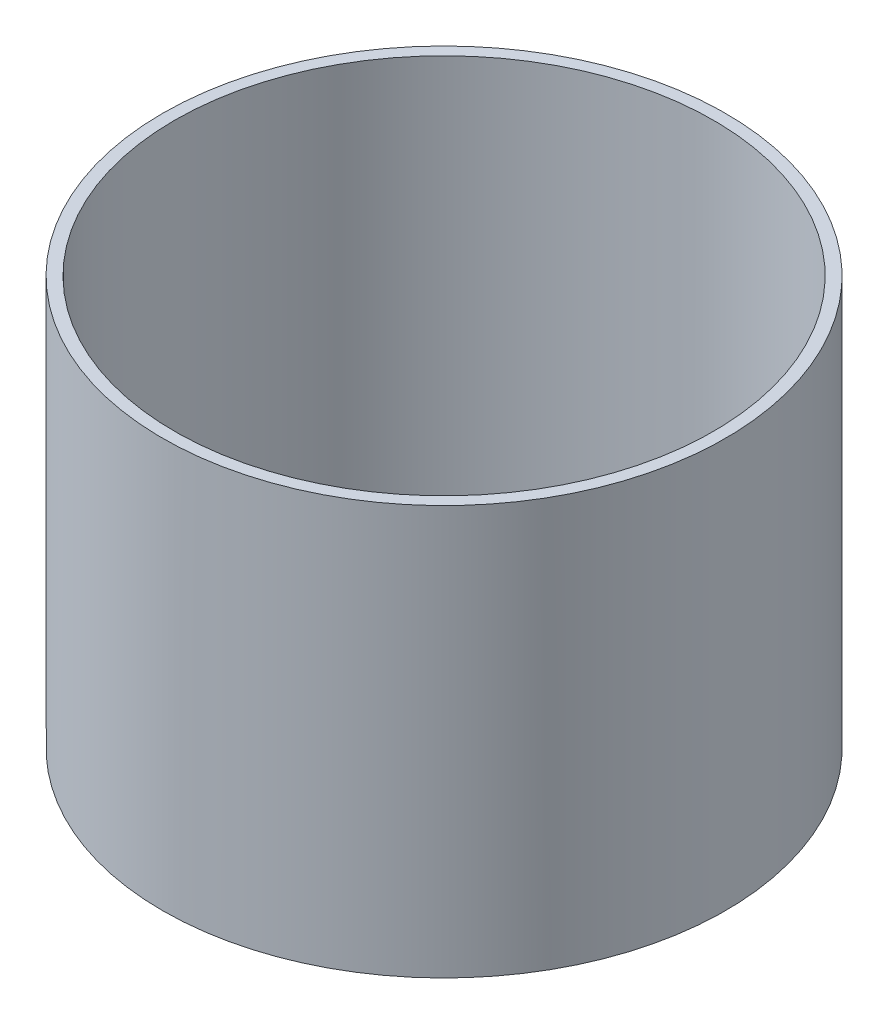
ISO-10303-21;
HEADER;
FILE_DESCRIPTION(('STEP AP214'),'2;1');
FILE_NAME('part.step','',(''),(''),'','','');
FILE_SCHEMA(('AUTOMOTIVE_DESIGN { 1 0 10303 214 1 1 1 1 }'));
ENDSEC;
DATA;
#1=APPLICATION_CONTEXT('core data for automotive mechanical design processes');
#2=APPLICATION_PROTOCOL_DEFINITION('international standard','automotive_design',2000,#1);
#3=PRODUCT_CONTEXT('',#1,'mechanical');
#4=PRODUCT('Part','Part','',(#3));
#5=PRODUCT_RELATED_PRODUCT_CATEGORY('part','',(#4));
#6=PRODUCT_DEFINITION_FORMATION('','',#4);
#7=PRODUCT_DEFINITION_CONTEXT('part definition',#1,'design');
#8=PRODUCT_DEFINITION('design','',#6,#7);
#9=PRODUCT_DEFINITION_SHAPE('','',#8);
#10=(LENGTH_UNIT() NAMED_UNIT(*) SI_UNIT(.MILLI.,.METRE.));
#11=(NAMED_UNIT(*) PLANE_ANGLE_UNIT() SI_UNIT($,.RADIAN.));
#12=(NAMED_UNIT(*) SI_UNIT($,.STERADIAN.) SOLID_ANGLE_UNIT());
#13=UNCERTAINTY_MEASURE_WITH_UNIT(LENGTH_MEASURE(1.E-05),#10,'distance_accuracy_value','');
#14=(GEOMETRIC_REPRESENTATION_CONTEXT(3) GLOBAL_UNCERTAINTY_ASSIGNED_CONTEXT((#13)) GLOBAL_UNIT_ASSIGNED_CONTEXT((#10,
#11,#12)) REPRESENTATION_CONTEXT('',''));
#15=CARTESIAN_POINT('',(0.,0.,0.));
#16=DIRECTION('',(0.,0.,1.));
#17=DIRECTION('',(1.,0.,0.));
#18=AXIS2_PLACEMENT_3D('',#15,#16,#17);
#19=CARTESIAN_POINT('',(0.,255.59597561254,0.));
#20=DIRECTION('',(0.,-1.,0.));
#21=DIRECTION('',(0.,0.,-1.));
#22=AXIS2_PLACEMENT_3D('',#19,#20,#21);
#23=CYLINDRICAL_SURFACE('',#22,59.69);
#24=CARTESIAN_POINT('',(0.,0.,0.));
#25=DIRECTION('',(0.,1.,0.));
#26=DIRECTION('',(0.,0.,1.));
#27=AXIS2_PLACEMENT_3D('',#24,#25,#26);
#28=CIRCLE('',#27,59.69);
#29=CARTESIAN_POINT('',(0.,0.,59.69));
#30=VERTEX_POINT('',#29);
#31=EDGE_CURVE('E45',#30,#30,#28,.T.);
#32=ORIENTED_EDGE('',*,*,#31,.T.);
#33=EDGE_LOOP('',(#32));
#34=FACE_BOUND('',#33,.T.);
#35=CARTESIAN_POINT('',(0.,86.7671605364402,0.));
#36=DIRECTION('',(0.,1.,0.));
#37=DIRECTION('',(-1.,0.,0.));
#38=AXIS2_PLACEMENT_3D('',#35,#36,#37);
#39=CIRCLE('',#38,59.69);
#40=CARTESIAN_POINT('',(-59.69,86.7671605364402,0.));
#41=VERTEX_POINT('',#40);
#42=EDGE_CURVE('E12',#41,#41,#39,.T.);
#43=ORIENTED_EDGE('',*,*,#42,.F.);
#44=EDGE_LOOP('',(#43));
#45=FACE_BOUND('',#44,.T.);
#46=ADVANCED_FACE('F38',(#34,#45),#23,.T.);
#47=CARTESIAN_POINT('',(0.,0.,0.));
#48=DIRECTION('',(0.,1.,0.));
#49=DIRECTION('',(0.,0.,1.));
#50=AXIS2_PLACEMENT_3D('',#47,#48,#49);
#51=PLANE('',#50);
#52=ORIENTED_EDGE('',*,*,#31,.F.);
#53=EDGE_LOOP('',(#52));
#54=FACE_BOUND('',#53,.T.);
#55=CARTESIAN_POINT('',(0.,0.,0.));
#56=DIRECTION('',(0.,1.,0.));
#57=DIRECTION('',(0.,0.,1.));
#58=AXIS2_PLACEMENT_3D('',#55,#56,#57);
#59=CIRCLE('',#58,57.15);
#60=CARTESIAN_POINT('',(0.,0.,57.15));
#61=VERTEX_POINT('',#60);
#62=EDGE_CURVE('E50',#61,#61,#59,.T.);
#63=ORIENTED_EDGE('',*,*,#62,.T.);
#64=EDGE_LOOP('',(#63));
#65=FACE_BOUND('',#64,.T.);
#66=ADVANCED_FACE('F66',(#54,#65),#51,.F.);
#67=CARTESIAN_POINT('',(0.,255.59597561254,0.));
#68=DIRECTION('',(0.,-1.,0.));
#69=DIRECTION('',(0.,0.,-1.));
#70=AXIS2_PLACEMENT_3D('',#67,#68,#69);
#71=CYLINDRICAL_SURFACE('',#70,57.15);
#72=ORIENTED_EDGE('',*,*,#62,.F.);
#73=EDGE_LOOP('',(#72));
#74=FACE_BOUND('',#73,.T.);
#75=CARTESIAN_POINT('',(0.,86.7671605364402,0.));
#76=DIRECTION('',(0.,1.,0.));
#77=DIRECTION('',(-1.,0.,0.));
#78=AXIS2_PLACEMENT_3D('',#75,#76,#77);
#79=CIRCLE('',#78,57.15);
#80=CARTESIAN_POINT('',(-57.15,86.7671605364402,0.));
#81=VERTEX_POINT('',#80);
#82=EDGE_CURVE('E41',#81,#81,#79,.T.);
#83=ORIENTED_EDGE('',*,*,#82,.T.);
#84=EDGE_LOOP('',(#83));
#85=FACE_BOUND('',#84,.T.);
#86=ADVANCED_FACE('F58',(#74,#85),#71,.F.);
#87=CARTESIAN_POINT('',(-3.79488453586894,86.7671605364402,51.4154012219293));
#88=DIRECTION('',(0.,1.,0.));
#89=DIRECTION('',(-1.,0.,0.));
#90=AXIS2_PLACEMENT_3D('',#87,#88,#89);
#91=PLANE('',#90);
#92=ORIENTED_EDGE('',*,*,#82,.F.);
#93=EDGE_LOOP('',(#92));
#94=FACE_BOUND('',#93,.T.);
#95=ORIENTED_EDGE('',*,*,#42,.T.);
#96=EDGE_LOOP('',(#95));
#97=FACE_BOUND('',#96,.T.);
#98=ADVANCED_FACE('F60',(#94,#97),#91,.T.);
#99=CLOSED_SHELL('',(#46,#66,#86,#98));
#100=MANIFOLD_SOLID_BREP('B2',#99);
#101=ADVANCED_BREP_SHAPE_REPRESENTATION('',(#18,#100),#14);
#102=SHAPE_DEFINITION_REPRESENTATION(#9,#101);
ENDSEC;
END-ISO-10303-21;
